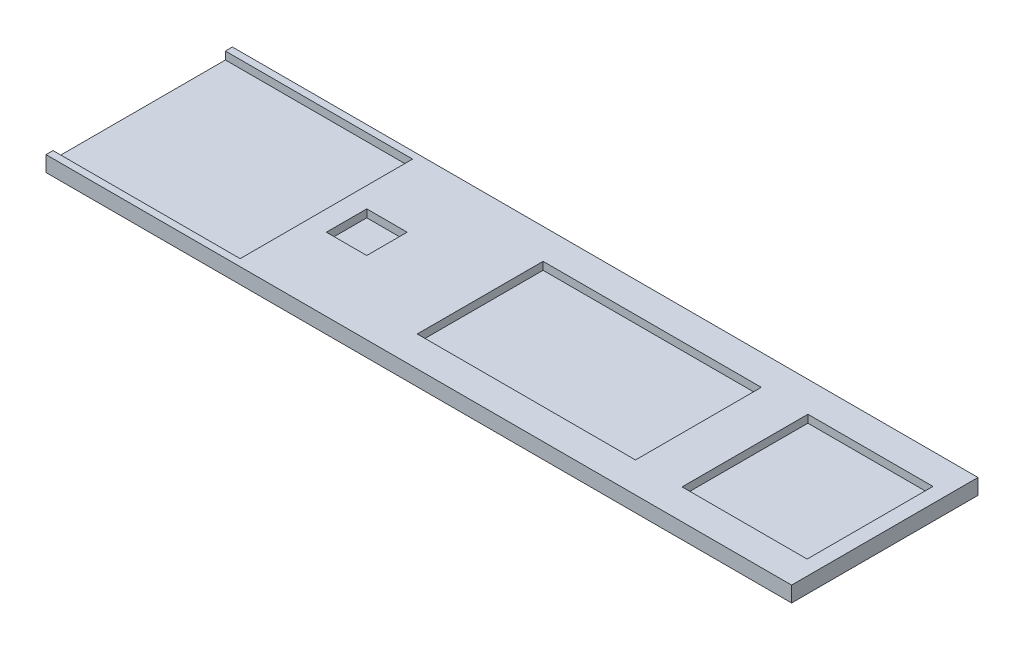
ISO-10303-21;
HEADER;
FILE_DESCRIPTION(('STEP AP214'),'2;1');
FILE_NAME('part.step','',(''),(''),'','','');
FILE_SCHEMA(('AUTOMOTIVE_DESIGN { 1 0 10303 214 1 1 1 1 }'));
ENDSEC;
DATA;
#1=APPLICATION_CONTEXT('core data for automotive mechanical design processes');
#2=APPLICATION_PROTOCOL_DEFINITION('international standard','automotive_design',2000,#1);
#3=PRODUCT_CONTEXT('',#1,'mechanical');
#4=PRODUCT('Part','Part','',(#3));
#5=PRODUCT_RELATED_PRODUCT_CATEGORY('part','',(#4));
#6=PRODUCT_DEFINITION_FORMATION('','',#4);
#7=PRODUCT_DEFINITION_CONTEXT('part definition',#1,'design');
#8=PRODUCT_DEFINITION('design','',#6,#7);
#9=PRODUCT_DEFINITION_SHAPE('','',#8);
#10=(LENGTH_UNIT() NAMED_UNIT(*) SI_UNIT(.MILLI.,.METRE.));
#11=(NAMED_UNIT(*) PLANE_ANGLE_UNIT() SI_UNIT($,.RADIAN.));
#12=(NAMED_UNIT(*) SI_UNIT($,.STERADIAN.) SOLID_ANGLE_UNIT());
#13=UNCERTAINTY_MEASURE_WITH_UNIT(LENGTH_MEASURE(1.E-05),#10,'distance_accuracy_value','');
#14=(GEOMETRIC_REPRESENTATION_CONTEXT(3) GLOBAL_UNCERTAINTY_ASSIGNED_CONTEXT((#13)) GLOBAL_UNIT_ASSIGNED_CONTEXT((#10,
#11,#12)) REPRESENTATION_CONTEXT('',''));
#15=CARTESIAN_POINT('',(0.,0.,0.));
#16=DIRECTION('',(0.,0.,1.));
#17=DIRECTION('',(1.,0.,0.));
#18=AXIS2_PLACEMENT_3D('',#15,#16,#17);
#19=CARTESIAN_POINT('',(-4.54092526690392,5.,-57.6868327402135));
#20=DIRECTION('',(1.,0.,0.));
#21=DIRECTION('',(0.,0.,-1.));
#22=AXIS2_PLACEMENT_3D('',#19,#20,#21);
#23=PLANE('',#22);
#24=DIRECTION('',(0.,0.,1.));
#25=VECTOR('',#24,1.);
#26=CARTESIAN_POINT('',(-4.54092526690392,2.5,-55.4368327402135));
#27=LINE('',#26,#25);
#28=CARTESIAN_POINT('',(-4.54092526690392,2.5,-55.4368327402135));
#29=VERTEX_POINT('',#28);
#30=CARTESIAN_POINT('',(-4.54092526690391,2.5,0.0631672597864799));
#31=VERTEX_POINT('',#30);
#32=EDGE_CURVE('E338',#29,#31,#27,.T.);
#33=ORIENTED_EDGE('',*,*,#32,.F.);
#34=DIRECTION('',(0.,1.,0.));
#35=VECTOR('',#34,1.);
#36=CARTESIAN_POINT('',(-4.54092526690392,2.5,-55.4368327402135));
#37=LINE('',#36,#35);
#38=CARTESIAN_POINT('',(-4.54092526690392,5.,-55.4368327402135));
#39=VERTEX_POINT('',#38);
#40=EDGE_CURVE('E330',#29,#39,#37,.T.);
#41=ORIENTED_EDGE('',*,*,#40,.T.);
#42=DIRECTION('',(0.,0.,1.));
#43=VECTOR('',#42,1.);
#44=CARTESIAN_POINT('',(-4.54092526690392,5.,-57.6868327402135));
#45=LINE('',#44,#43);
#46=CARTESIAN_POINT('',(-4.54092526690392,5.,-57.6868327402135));
#47=VERTEX_POINT('',#46);
#48=EDGE_CURVE('E359',#47,#39,#45,.T.);
#49=ORIENTED_EDGE('',*,*,#48,.F.);
#50=DIRECTION('',(0.,-1.,0.));
#51=VECTOR('',#50,1.);
#52=CARTESIAN_POINT('',(-4.54092526690392,5.,-57.6868327402135));
#53=LINE('',#52,#51);
#54=CARTESIAN_POINT('',(-4.54092526690392,0.,-57.6868327402135));
#55=VERTEX_POINT('',#54);
#56=EDGE_CURVE('E373',#47,#55,#53,.T.);
#57=ORIENTED_EDGE('',*,*,#56,.T.);
#58=DIRECTION('',(0.,0.,1.));
#59=VECTOR('',#58,1.);
#60=CARTESIAN_POINT('',(-4.54092526690392,0.,-57.6868327402135));
#61=LINE('',#60,#59);
#62=CARTESIAN_POINT('',(-4.54092526690391,0.,2.31316725978648));
#63=VERTEX_POINT('',#62);
#64=EDGE_CURVE('E227',#55,#63,#61,.T.);
#65=ORIENTED_EDGE('',*,*,#64,.T.);
#66=DIRECTION('',(0.,-1.,0.));
#67=VECTOR('',#66,1.);
#68=CARTESIAN_POINT('',(-4.54092526690391,5.,2.31316725978648));
#69=LINE('',#68,#67);
#70=CARTESIAN_POINT('',(-4.54092526690391,5.,2.31316725978648));
#71=VERTEX_POINT('',#70);
#72=EDGE_CURVE('E11',#71,#63,#69,.T.);
#73=ORIENTED_EDGE('',*,*,#72,.F.);
#74=CARTESIAN_POINT('',(-4.54092526690391,5.,0.0631672597864799));
#75=VERTEX_POINT('',#74);
#76=EDGE_CURVE('E364',#75,#71,#45,.T.);
#77=ORIENTED_EDGE('',*,*,#76,.F.);
#78=DIRECTION('',(0.,1.,0.));
#79=VECTOR('',#78,1.);
#80=CARTESIAN_POINT('',(-4.54092526690391,2.5,0.0631672597864799));
#81=LINE('',#80,#79);
#82=EDGE_CURVE('E320',#31,#75,#81,.T.);
#83=ORIENTED_EDGE('',*,*,#82,.F.);
#84=EDGE_LOOP('',(#33,#41,#49,#57,#65,#73,#77,#83));
#85=FACE_BOUND('',#84,.T.);
#86=ADVANCED_FACE('F45',(#85),#23,.F.);
#87=CARTESIAN_POINT('',(-4.54092526690391,5.,2.31316725978648));
#88=DIRECTION('',(0.,0.,-1.));
#89=DIRECTION('',(-1.,0.,0.));
#90=AXIS2_PLACEMENT_3D('',#87,#88,#89);
#91=PLANE('',#90);
#92=DIRECTION('',(1.,0.,0.));
#93=VECTOR('',#92,1.);
#94=CARTESIAN_POINT('',(-4.54092526690391,0.,2.31316725978648));
#95=LINE('',#94,#93);
#96=CARTESIAN_POINT('',(235.459074733096,0.,2.31316725978647));
#97=VERTEX_POINT('',#96);
#98=EDGE_CURVE('E377',#63,#97,#95,.T.);
#99=ORIENTED_EDGE('',*,*,#98,.T.);
#100=DIRECTION('',(0.,-1.,0.));
#101=VECTOR('',#100,1.);
#102=CARTESIAN_POINT('',(235.459074733096,5.,2.31316725978647));
#103=LINE('',#102,#101);
#104=CARTESIAN_POINT('',(235.459074733096,5.,2.31316725978647));
#105=VERTEX_POINT('',#104);
#106=EDGE_CURVE('E53',#105,#97,#103,.T.);
#107=ORIENTED_EDGE('',*,*,#106,.F.);
#108=DIRECTION('',(1.,0.,0.));
#109=VECTOR('',#108,1.);
#110=CARTESIAN_POINT('',(-4.54092526690391,5.,2.31316725978648));
#111=LINE('',#110,#109);
#112=EDGE_CURVE('E363',#71,#105,#111,.T.);
#113=ORIENTED_EDGE('',*,*,#112,.F.);
#114=ORIENTED_EDGE('',*,*,#72,.T.);
#115=EDGE_LOOP('',(#99,#107,#113,#114));
#116=FACE_BOUND('',#115,.T.);
#117=ADVANCED_FACE('F420',(#116),#91,.F.);
#118=CARTESIAN_POINT('',(235.459074733096,5.,-57.6868327402135));
#119=DIRECTION('',(-1.,0.,0.));
#120=DIRECTION('',(0.,0.,1.));
#121=AXIS2_PLACEMENT_3D('',#118,#119,#120);
#122=PLANE('',#121);
#123=DIRECTION('',(0.,0.,-1.));
#124=VECTOR('',#123,1.);
#125=CARTESIAN_POINT('',(235.459074733096,0.,-57.6868327402135));
#126=LINE('',#125,#124);
#127=CARTESIAN_POINT('',(235.459074733096,0.,-57.6868327402135));
#128=VERTEX_POINT('',#127);
#129=EDGE_CURVE('E380',#97,#128,#126,.T.);
#130=ORIENTED_EDGE('',*,*,#129,.T.);
#131=DIRECTION('',(0.,-1.,0.));
#132=VECTOR('',#131,1.);
#133=CARTESIAN_POINT('',(235.459074733096,5.,-57.6868327402135));
#134=LINE('',#133,#132);
#135=CARTESIAN_POINT('',(235.459074733096,5.,-57.6868327402135));
#136=VERTEX_POINT('',#135);
#137=EDGE_CURVE('E389',#136,#128,#134,.T.);
#138=ORIENTED_EDGE('',*,*,#137,.F.);
#139=DIRECTION('',(0.,0.,-1.));
#140=VECTOR('',#139,1.);
#141=CARTESIAN_POINT('',(235.459074733096,5.,-57.6868327402135));
#142=LINE('',#141,#140);
#143=EDGE_CURVE('E367',#105,#136,#142,.T.);
#144=ORIENTED_EDGE('',*,*,#143,.F.);
#145=ORIENTED_EDGE('',*,*,#106,.T.);
#146=EDGE_LOOP('',(#130,#138,#144,#145));
#147=FACE_BOUND('',#146,.T.);
#148=ADVANCED_FACE('F398',(#147),#122,.F.);
#149=CARTESIAN_POINT('',(-4.54092526690392,5.,-57.6868327402135));
#150=DIRECTION('',(0.,0.,1.));
#151=DIRECTION('',(1.,0.,0.));
#152=AXIS2_PLACEMENT_3D('',#149,#150,#151);
#153=PLANE('',#152);
#154=DIRECTION('',(-1.,0.,0.));
#155=VECTOR('',#154,1.);
#156=CARTESIAN_POINT('',(-4.54092526690392,0.,-57.6868327402135));
#157=LINE('',#156,#155);
#158=EDGE_CURVE('E383',#128,#55,#157,.T.);
#159=ORIENTED_EDGE('',*,*,#158,.T.);
#160=ORIENTED_EDGE('',*,*,#56,.F.);
#161=DIRECTION('',(-1.,0.,0.));
#162=VECTOR('',#161,1.);
#163=CARTESIAN_POINT('',(-4.54092526690392,5.,-57.6868327402135));
#164=LINE('',#163,#162);
#165=EDGE_CURVE('E370',#136,#47,#164,.T.);
#166=ORIENTED_EDGE('',*,*,#165,.F.);
#167=ORIENTED_EDGE('',*,*,#137,.T.);
#168=EDGE_LOOP('',(#159,#160,#166,#167));
#169=FACE_BOUND('',#168,.T.);
#170=ADVANCED_FACE('F408',(#169),#153,.F.);
#171=CARTESIAN_POINT('',(0.,5.,0.));
#172=DIRECTION('',(0.,1.,0.));
#173=DIRECTION('',(0.,0.,1.));
#174=AXIS2_PLACEMENT_3D('',#171,#172,#173);
#175=PLANE('',#174);
#176=DIRECTION('',(0.,0.,1.));
#177=VECTOR('',#176,1.);
#178=CARTESIAN_POINT('',(190.459074733096,5.,-47.9368327402135));
#179=LINE('',#178,#177);
#180=CARTESIAN_POINT('',(190.459074733096,5.,-47.9368327402135));
#181=VERTEX_POINT('',#180);
#182=CARTESIAN_POINT('',(190.459074733096,5.,-7.43683274021352));
#183=VERTEX_POINT('',#182);
#184=EDGE_CURVE('E60',#181,#183,#179,.T.);
#185=ORIENTED_EDGE('',*,*,#184,.F.);
#186=DIRECTION('',(-1.,0.,0.));
#187=VECTOR('',#186,1.);
#188=CARTESIAN_POINT('',(190.459074733096,5.,-47.9368327402135));
#189=LINE('',#188,#187);
#190=CARTESIAN_POINT('',(230.709074733096,5.,-47.9368327402135));
#191=VERTEX_POINT('',#190);
#192=EDGE_CURVE('E205',#191,#181,#189,.T.);
#193=ORIENTED_EDGE('',*,*,#192,.F.);
#194=DIRECTION('',(0.,0.,-1.));
#195=VECTOR('',#194,1.);
#196=CARTESIAN_POINT('',(230.709074733096,5.,-47.9368327402135));
#197=LINE('',#196,#195);
#198=CARTESIAN_POINT('',(230.709074733096,5.,-7.43683274021352));
#199=VERTEX_POINT('',#198);
#200=EDGE_CURVE('E209',#199,#191,#197,.T.);
#201=ORIENTED_EDGE('',*,*,#200,.F.);
#202=DIRECTION('',(1.,0.,0.));
#203=VECTOR('',#202,1.);
#204=CARTESIAN_POINT('',(190.459074733096,5.,-7.43683274021352));
#205=LINE('',#204,#203);
#206=EDGE_CURVE('E218',#183,#199,#205,.T.);
#207=ORIENTED_EDGE('',*,*,#206,.F.);
#208=EDGE_LOOP('',(#185,#193,#201,#207));
#209=FACE_BOUND('',#208,.T.);
#210=DIRECTION('',(0.,0.,1.));
#211=VECTOR('',#210,1.);
#212=CARTESIAN_POINT('',(105.209074733096,5.,-47.9368327402135));
#213=LINE('',#212,#211);
#214=CARTESIAN_POINT('',(105.209074733096,5.,-47.9368327402135));
#215=VERTEX_POINT('',#214);
#216=CARTESIAN_POINT('',(105.209074733096,5.,-7.43683274021352));
#217=VERTEX_POINT('',#216);
#218=EDGE_CURVE('E68',#215,#217,#213,.T.);
#219=ORIENTED_EDGE('',*,*,#218,.F.);
#220=DIRECTION('',(-1.,0.,0.));
#221=VECTOR('',#220,1.);
#222=CARTESIAN_POINT('',(105.209074733096,5.,-47.9368327402135));
#223=LINE('',#222,#221);
#224=CARTESIAN_POINT('',(175.459074733096,5.,-47.9368327402135));
#225=VERTEX_POINT('',#224);
#226=EDGE_CURVE('E247',#225,#215,#223,.T.);
#227=ORIENTED_EDGE('',*,*,#226,.F.);
#228=DIRECTION('',(0.,0.,-1.));
#229=VECTOR('',#228,1.);
#230=CARTESIAN_POINT('',(175.459074733096,5.,-47.9368327402135));
#231=LINE('',#230,#229);
#232=CARTESIAN_POINT('',(175.459074733096,5.,-7.43683274021352));
#233=VERTEX_POINT('',#232);
#234=EDGE_CURVE('E251',#233,#225,#231,.T.);
#235=ORIENTED_EDGE('',*,*,#234,.F.);
#236=DIRECTION('',(1.,0.,0.));
#237=VECTOR('',#236,1.);
#238=CARTESIAN_POINT('',(105.209074733096,5.,-7.43683274021352));
#239=LINE('',#238,#237);
#240=EDGE_CURVE('E256',#217,#233,#239,.T.);
#241=ORIENTED_EDGE('',*,*,#240,.F.);
#242=EDGE_LOOP('',(#219,#227,#235,#241));
#243=FACE_BOUND('',#242,.T.);
#244=DIRECTION('',(0.,0.,1.));
#245=VECTOR('',#244,1.);
#246=CARTESIAN_POINT('',(62.2090747330961,5.,-34.1868327402135));
#247=LINE('',#246,#245);
#248=CARTESIAN_POINT('',(62.2090747330961,5.,-34.1868327402135));
#249=VERTEX_POINT('',#248);
#250=CARTESIAN_POINT('',(62.2090747330961,5.,-21.1868327402135));
#251=VERTEX_POINT('',#250);
#252=EDGE_CURVE('E246',#249,#251,#247,.T.);
#253=ORIENTED_EDGE('',*,*,#252,.F.);
#254=DIRECTION('',(-1.,0.,0.));
#255=VECTOR('',#254,1.);
#256=CARTESIAN_POINT('',(62.2090747330961,5.,-34.1868327402135));
#257=LINE('',#256,#255);
#258=CARTESIAN_POINT('',(75.2090747330961,5.,-34.1868327402135));
#259=VERTEX_POINT('',#258);
#260=EDGE_CURVE('E291',#259,#249,#257,.T.);
#261=ORIENTED_EDGE('',*,*,#260,.F.);
#262=DIRECTION('',(0.,0.,-1.));
#263=VECTOR('',#262,1.);
#264=CARTESIAN_POINT('',(75.2090747330961,5.,-34.1868327402135));
#265=LINE('',#264,#263);
#266=CARTESIAN_POINT('',(75.2090747330961,5.,-21.1868327402135));
#267=VERTEX_POINT('',#266);
#268=EDGE_CURVE('E295',#267,#259,#265,.T.);
#269=ORIENTED_EDGE('',*,*,#268,.F.);
#270=DIRECTION('',(1.,0.,0.));
#271=VECTOR('',#270,1.);
#272=CARTESIAN_POINT('',(62.2090747330961,5.,-21.1868327402135));
#273=LINE('',#272,#271);
#274=EDGE_CURVE('E300',#251,#267,#273,.T.);
#275=ORIENTED_EDGE('',*,*,#274,.F.);
#276=EDGE_LOOP('',(#253,#261,#269,#275));
#277=FACE_BOUND('',#276,.T.);
#278=DIRECTION('',(-1.,0.,0.));
#279=VECTOR('',#278,1.);
#280=CARTESIAN_POINT('',(-4.54092526690392,5.,-55.4368327402135));
#281=LINE('',#280,#279);
#282=CARTESIAN_POINT('',(55.7090747330961,5.,-55.4368327402135));
#283=VERTEX_POINT('',#282);
#284=EDGE_CURVE('E334',#283,#39,#281,.T.);
#285=ORIENTED_EDGE('',*,*,#284,.F.);
#286=DIRECTION('',(0.,0.,-1.));
#287=VECTOR('',#286,1.);
#288=CARTESIAN_POINT('',(55.7090747330961,5.,-55.4368327402135));
#289=LINE('',#288,#287);
#290=CARTESIAN_POINT('',(55.7090747330961,5.,0.0631672597864799));
#291=VERTEX_POINT('',#290);
#292=EDGE_CURVE('E337',#291,#283,#289,.T.);
#293=ORIENTED_EDGE('',*,*,#292,.F.);
#294=DIRECTION('',(1.,0.,0.));
#295=VECTOR('',#294,1.);
#296=CARTESIAN_POINT('',(-4.54092526690391,5.,0.0631672597864799));
#297=LINE('',#296,#295);
#298=EDGE_CURVE('E290',#75,#291,#297,.T.);
#299=ORIENTED_EDGE('',*,*,#298,.F.);
#300=ORIENTED_EDGE('',*,*,#76,.T.);
#301=ORIENTED_EDGE('',*,*,#112,.T.);
#302=ORIENTED_EDGE('',*,*,#143,.T.);
#303=ORIENTED_EDGE('',*,*,#165,.T.);
#304=ORIENTED_EDGE('',*,*,#48,.T.);
#305=EDGE_LOOP('',(#285,#293,#299,#300,#301,#302,#303,#304));
#306=FACE_BOUND('',#305,.T.);
#307=ADVANCED_FACE('F416',(#209,#243,#277,#306),#175,.T.);
#308=CARTESIAN_POINT('',(0.,0.,0.));
#309=DIRECTION('',(0.,1.,0.));
#310=DIRECTION('',(0.,0.,1.));
#311=AXIS2_PLACEMENT_3D('',#308,#309,#310);
#312=PLANE('',#311);
#313=ORIENTED_EDGE('',*,*,#64,.F.);
#314=ORIENTED_EDGE('',*,*,#158,.F.);
#315=ORIENTED_EDGE('',*,*,#129,.F.);
#316=ORIENTED_EDGE('',*,*,#98,.F.);
#317=EDGE_LOOP('',(#313,#314,#315,#316));
#318=FACE_BOUND('',#317,.T.);
#319=ADVANCED_FACE('F405',(#318),#312,.F.);
#320=CARTESIAN_POINT('',(-4.54092526690392,2.5,-55.4368327402135));
#321=DIRECTION('',(0.,0.,-1.));
#322=DIRECTION('',(-1.,0.,0.));
#323=AXIS2_PLACEMENT_3D('',#320,#321,#322);
#324=PLANE('',#323);
#325=ORIENTED_EDGE('',*,*,#284,.T.);
#326=ORIENTED_EDGE('',*,*,#40,.F.);
#327=DIRECTION('',(-1.,0.,0.));
#328=VECTOR('',#327,1.);
#329=CARTESIAN_POINT('',(-4.54092526690392,2.5,-55.4368327402135));
#330=LINE('',#329,#328);
#331=CARTESIAN_POINT('',(55.7090747330961,2.5,-55.4368327402135));
#332=VERTEX_POINT('',#331);
#333=EDGE_CURVE('E323',#332,#29,#330,.T.);
#334=ORIENTED_EDGE('',*,*,#333,.F.);
#335=DIRECTION('',(0.,1.,0.));
#336=VECTOR('',#335,1.);
#337=CARTESIAN_POINT('',(55.7090747330961,2.5,-55.4368327402135));
#338=LINE('',#337,#336);
#339=EDGE_CURVE('E327',#332,#283,#338,.T.);
#340=ORIENTED_EDGE('',*,*,#339,.T.);
#341=EDGE_LOOP('',(#325,#326,#334,#340));
#342=FACE_BOUND('',#341,.T.);
#343=ADVANCED_FACE('F432',(#342),#324,.F.);
#344=CARTESIAN_POINT('',(55.7090747330961,2.5,-55.4368327402135));
#345=DIRECTION('',(1.,0.,0.));
#346=DIRECTION('',(0.,0.,-1.));
#347=AXIS2_PLACEMENT_3D('',#344,#345,#346);
#348=PLANE('',#347);
#349=ORIENTED_EDGE('',*,*,#292,.T.);
#350=ORIENTED_EDGE('',*,*,#339,.F.);
#351=DIRECTION('',(0.,0.,-1.));
#352=VECTOR('',#351,1.);
#353=CARTESIAN_POINT('',(55.7090747330961,2.5,-55.4368327402135));
#354=LINE('',#353,#352);
#355=CARTESIAN_POINT('',(55.7090747330961,2.5,0.0631672597864799));
#356=VERTEX_POINT('',#355);
#357=EDGE_CURVE('E348',#356,#332,#354,.T.);
#358=ORIENTED_EDGE('',*,*,#357,.F.);
#359=DIRECTION('',(0.,1.,0.));
#360=VECTOR('',#359,1.);
#361=CARTESIAN_POINT('',(55.7090747330961,2.5,0.0631672597864799));
#362=LINE('',#361,#360);
#363=EDGE_CURVE('E324',#356,#291,#362,.T.);
#364=ORIENTED_EDGE('',*,*,#363,.T.);
#365=EDGE_LOOP('',(#349,#350,#358,#364));
#366=FACE_BOUND('',#365,.T.);
#367=ADVANCED_FACE('F426',(#366),#348,.F.);
#368=CARTESIAN_POINT('',(-4.54092526690391,2.5,0.0631672597864799));
#369=DIRECTION('',(0.,0.,1.));
#370=DIRECTION('',(1.,0.,0.));
#371=AXIS2_PLACEMENT_3D('',#368,#369,#370);
#372=PLANE('',#371);
#373=ORIENTED_EDGE('',*,*,#298,.T.);
#374=ORIENTED_EDGE('',*,*,#363,.F.);
#375=DIRECTION('',(1.,0.,0.));
#376=VECTOR('',#375,1.);
#377=CARTESIAN_POINT('',(-4.54092526690391,2.5,0.0631672597864799));
#378=LINE('',#377,#376);
#379=EDGE_CURVE('E352',#31,#356,#378,.T.);
#380=ORIENTED_EDGE('',*,*,#379,.F.);
#381=ORIENTED_EDGE('',*,*,#82,.T.);
#382=EDGE_LOOP('',(#373,#374,#380,#381));
#383=FACE_BOUND('',#382,.T.);
#384=ADVANCED_FACE('F424',(#383),#372,.F.);
#385=CARTESIAN_POINT('',(0.,2.5,0.));
#386=DIRECTION('',(0.,1.,0.));
#387=DIRECTION('',(0.,0.,1.));
#388=AXIS2_PLACEMENT_3D('',#385,#386,#387);
#389=PLANE('',#388);
#390=ORIENTED_EDGE('',*,*,#32,.T.);
#391=ORIENTED_EDGE('',*,*,#379,.T.);
#392=ORIENTED_EDGE('',*,*,#357,.T.);
#393=ORIENTED_EDGE('',*,*,#333,.T.);
#394=EDGE_LOOP('',(#390,#391,#392,#393));
#395=FACE_BOUND('',#394,.T.);
#396=ADVANCED_FACE('F430',(#395),#389,.T.);
#397=CARTESIAN_POINT('',(62.2090747330961,2.5,-34.1868327402135));
#398=DIRECTION('',(-1.,0.,0.));
#399=DIRECTION('',(0.,0.,1.));
#400=AXIS2_PLACEMENT_3D('',#397,#398,#399);
#401=PLANE('',#400);
#402=ORIENTED_EDGE('',*,*,#252,.T.);
#403=DIRECTION('',(0.,1.,0.));
#404=VECTOR('',#403,1.);
#405=CARTESIAN_POINT('',(62.2090747330961,2.5,-21.1868327402135));
#406=LINE('',#405,#404);
#407=CARTESIAN_POINT('',(62.2090747330961,2.5,-21.1868327402135));
#408=VERTEX_POINT('',#407);
#409=EDGE_CURVE('E276',#408,#251,#406,.T.);
#410=ORIENTED_EDGE('',*,*,#409,.F.);
#411=DIRECTION('',(0.,0.,1.));
#412=VECTOR('',#411,1.);
#413=CARTESIAN_POINT('',(62.2090747330961,2.5,-34.1868327402135));
#414=LINE('',#413,#412);
#415=CARTESIAN_POINT('',(62.2090747330961,2.5,-34.1868327402135));
#416=VERTEX_POINT('',#415);
#417=EDGE_CURVE('E296',#416,#408,#414,.T.);
#418=ORIENTED_EDGE('',*,*,#417,.F.);
#419=DIRECTION('',(0.,1.,0.));
#420=VECTOR('',#419,1.);
#421=CARTESIAN_POINT('',(62.2090747330961,2.5,-34.1868327402135));
#422=LINE('',#421,#420);
#423=EDGE_CURVE('E287',#416,#249,#422,.T.);
#424=ORIENTED_EDGE('',*,*,#423,.T.);
#425=EDGE_LOOP('',(#402,#410,#418,#424));
#426=FACE_BOUND('',#425,.T.);
#427=ADVANCED_FACE('F456',(#426),#401,.F.);
#428=CARTESIAN_POINT('',(62.2090747330961,2.5,-34.1868327402135));
#429=DIRECTION('',(0.,0.,-1.));
#430=DIRECTION('',(-1.,0.,0.));
#431=AXIS2_PLACEMENT_3D('',#428,#429,#430);
#432=PLANE('',#431);
#433=ORIENTED_EDGE('',*,*,#260,.T.);
#434=ORIENTED_EDGE('',*,*,#423,.F.);
#435=DIRECTION('',(-1.,0.,0.));
#436=VECTOR('',#435,1.);
#437=CARTESIAN_POINT('',(62.2090747330961,2.5,-34.1868327402135));
#438=LINE('',#437,#436);
#439=CARTESIAN_POINT('',(75.2090747330961,2.5,-34.1868327402135));
#440=VERTEX_POINT('',#439);
#441=EDGE_CURVE('E280',#440,#416,#438,.T.);
#442=ORIENTED_EDGE('',*,*,#441,.F.);
#443=DIRECTION('',(0.,1.,0.));
#444=VECTOR('',#443,1.);
#445=CARTESIAN_POINT('',(75.2090747330961,2.5,-34.1868327402135));
#446=LINE('',#445,#444);
#447=EDGE_CURVE('E284',#440,#259,#446,.T.);
#448=ORIENTED_EDGE('',*,*,#447,.T.);
#449=EDGE_LOOP('',(#433,#434,#442,#448));
#450=FACE_BOUND('',#449,.T.);
#451=ADVANCED_FACE('F461',(#450),#432,.F.);
#452=CARTESIAN_POINT('',(75.2090747330961,2.5,-34.1868327402135));
#453=DIRECTION('',(1.,0.,0.));
#454=DIRECTION('',(0.,0.,-1.));
#455=AXIS2_PLACEMENT_3D('',#452,#453,#454);
#456=PLANE('',#455);
#457=ORIENTED_EDGE('',*,*,#268,.T.);
#458=ORIENTED_EDGE('',*,*,#447,.F.);
#459=DIRECTION('',(0.,0.,-1.));
#460=VECTOR('',#459,1.);
#461=CARTESIAN_POINT('',(75.2090747330961,2.5,-34.1868327402135));
#462=LINE('',#461,#460);
#463=CARTESIAN_POINT('',(75.2090747330961,2.5,-21.1868327402135));
#464=VERTEX_POINT('',#463);
#465=EDGE_CURVE('E309',#464,#440,#462,.T.);
#466=ORIENTED_EDGE('',*,*,#465,.F.);
#467=DIRECTION('',(0.,1.,0.));
#468=VECTOR('',#467,1.);
#469=CARTESIAN_POINT('',(75.2090747330961,2.5,-21.1868327402135));
#470=LINE('',#469,#468);
#471=EDGE_CURVE('E281',#464,#267,#470,.T.);
#472=ORIENTED_EDGE('',*,*,#471,.T.);
#473=EDGE_LOOP('',(#457,#458,#466,#472));
#474=FACE_BOUND('',#473,.T.);
#475=ADVANCED_FACE('F476',(#474),#456,.F.);
#476=CARTESIAN_POINT('',(62.2090747330961,2.5,-21.1868327402135));
#477=DIRECTION('',(0.,0.,1.));
#478=DIRECTION('',(1.,0.,0.));
#479=AXIS2_PLACEMENT_3D('',#476,#477,#478);
#480=PLANE('',#479);
#481=ORIENTED_EDGE('',*,*,#274,.T.);
#482=ORIENTED_EDGE('',*,*,#471,.F.);
#483=DIRECTION('',(1.,0.,0.));
#484=VECTOR('',#483,1.);
#485=CARTESIAN_POINT('',(62.2090747330961,2.5,-21.1868327402135));
#486=LINE('',#485,#484);
#487=EDGE_CURVE('E313',#408,#464,#486,.T.);
#488=ORIENTED_EDGE('',*,*,#487,.F.);
#489=ORIENTED_EDGE('',*,*,#409,.T.);
#490=EDGE_LOOP('',(#481,#482,#488,#489));
#491=FACE_BOUND('',#490,.T.);
#492=ADVANCED_FACE('F472',(#491),#480,.F.);
#493=CARTESIAN_POINT('',(0.,2.5,0.));
#494=DIRECTION('',(0.,1.,0.));
#495=DIRECTION('',(0.,0.,1.));
#496=AXIS2_PLACEMENT_3D('',#493,#494,#495);
#497=PLANE('',#496);
#498=ORIENTED_EDGE('',*,*,#417,.T.);
#499=ORIENTED_EDGE('',*,*,#487,.T.);
#500=ORIENTED_EDGE('',*,*,#465,.T.);
#501=ORIENTED_EDGE('',*,*,#441,.T.);
#502=EDGE_LOOP('',(#498,#499,#500,#501));
#503=FACE_BOUND('',#502,.T.);
#504=ADVANCED_FACE('F468',(#503),#497,.T.);
#505=CARTESIAN_POINT('',(105.209074733096,2.5,-47.9368327402135));
#506=DIRECTION('',(-1.,0.,0.));
#507=DIRECTION('',(0.,0.,1.));
#508=AXIS2_PLACEMENT_3D('',#505,#506,#507);
#509=PLANE('',#508);
#510=ORIENTED_EDGE('',*,*,#218,.T.);
#511=DIRECTION('',(0.,1.,0.));
#512=VECTOR('',#511,1.);
#513=CARTESIAN_POINT('',(105.209074733096,2.5,-7.43683274021352));
#514=LINE('',#513,#512);
#515=CARTESIAN_POINT('',(105.209074733096,2.5,-7.43683274021352));
#516=VERTEX_POINT('',#515);
#517=EDGE_CURVE('E233',#516,#217,#514,.T.);
#518=ORIENTED_EDGE('',*,*,#517,.F.);
#519=DIRECTION('',(0.,0.,1.));
#520=VECTOR('',#519,1.);
#521=CARTESIAN_POINT('',(105.209074733096,2.5,-47.9368327402135));
#522=LINE('',#521,#520);
#523=CARTESIAN_POINT('',(105.209074733096,2.5,-47.9368327402135));
#524=VERTEX_POINT('',#523);
#525=EDGE_CURVE('E252',#524,#516,#522,.T.);
#526=ORIENTED_EDGE('',*,*,#525,.F.);
#527=DIRECTION('',(0.,1.,0.));
#528=VECTOR('',#527,1.);
#529=CARTESIAN_POINT('',(105.209074733096,2.5,-47.9368327402135));
#530=LINE('',#529,#528);
#531=EDGE_CURVE('E243',#524,#215,#530,.T.);
#532=ORIENTED_EDGE('',*,*,#531,.T.);
#533=EDGE_LOOP('',(#510,#518,#526,#532));
#534=FACE_BOUND('',#533,.T.);
#535=ADVANCED_FACE('F471',(#534),#509,.F.);
#536=CARTESIAN_POINT('',(105.209074733096,2.5,-47.9368327402135));
#537=DIRECTION('',(0.,0.,-1.));
#538=DIRECTION('',(-1.,0.,0.));
#539=AXIS2_PLACEMENT_3D('',#536,#537,#538);
#540=PLANE('',#539);
#541=ORIENTED_EDGE('',*,*,#226,.T.);
#542=ORIENTED_EDGE('',*,*,#531,.F.);
#543=DIRECTION('',(-1.,0.,0.));
#544=VECTOR('',#543,1.);
#545=CARTESIAN_POINT('',(105.209074733096,2.5,-47.9368327402135));
#546=LINE('',#545,#544);
#547=CARTESIAN_POINT('',(175.459074733096,2.5,-47.9368327402135));
#548=VERTEX_POINT('',#547);
#549=EDGE_CURVE('E236',#548,#524,#546,.T.);
#550=ORIENTED_EDGE('',*,*,#549,.F.);
#551=DIRECTION('',(0.,1.,0.));
#552=VECTOR('',#551,1.);
#553=CARTESIAN_POINT('',(175.459074733096,2.5,-47.9368327402135));
#554=LINE('',#553,#552);
#555=EDGE_CURVE('E240',#548,#225,#554,.T.);
#556=ORIENTED_EDGE('',*,*,#555,.T.);
#557=EDGE_LOOP('',(#541,#542,#550,#556));
#558=FACE_BOUND('',#557,.T.);
#559=ADVANCED_FACE('F489',(#558),#540,.F.);
#560=CARTESIAN_POINT('',(175.459074733096,2.5,-47.9368327402135));
#561=DIRECTION('',(1.,0.,0.));
#562=DIRECTION('',(0.,0.,-1.));
#563=AXIS2_PLACEMENT_3D('',#560,#561,#562);
#564=PLANE('',#563);
#565=ORIENTED_EDGE('',*,*,#234,.T.);
#566=ORIENTED_EDGE('',*,*,#555,.F.);
#567=DIRECTION('',(0.,0.,-1.));
#568=VECTOR('',#567,1.);
#569=CARTESIAN_POINT('',(175.459074733096,2.5,-47.9368327402135));
#570=LINE('',#569,#568);
#571=CARTESIAN_POINT('',(175.459074733096,2.5,-7.43683274021352));
#572=VERTEX_POINT('',#571);
#573=EDGE_CURVE('E265',#572,#548,#570,.T.);
#574=ORIENTED_EDGE('',*,*,#573,.F.);
#575=DIRECTION('',(0.,1.,0.));
#576=VECTOR('',#575,1.);
#577=CARTESIAN_POINT('',(175.459074733096,2.5,-7.43683274021352));
#578=LINE('',#577,#576);
#579=EDGE_CURVE('E237',#572,#233,#578,.T.);
#580=ORIENTED_EDGE('',*,*,#579,.T.);
#581=EDGE_LOOP('',(#565,#566,#574,#580));
#582=FACE_BOUND('',#581,.T.);
#583=ADVANCED_FACE('F492',(#582),#564,.F.);
#584=CARTESIAN_POINT('',(105.209074733096,2.5,-7.43683274021352));
#585=DIRECTION('',(0.,0.,1.));
#586=DIRECTION('',(1.,0.,0.));
#587=AXIS2_PLACEMENT_3D('',#584,#585,#586);
#588=PLANE('',#587);
#589=ORIENTED_EDGE('',*,*,#240,.T.);
#590=ORIENTED_EDGE('',*,*,#579,.F.);
#591=DIRECTION('',(1.,0.,0.));
#592=VECTOR('',#591,1.);
#593=CARTESIAN_POINT('',(105.209074733096,2.5,-7.43683274021352));
#594=LINE('',#593,#592);
#595=EDGE_CURVE('E269',#516,#572,#594,.T.);
#596=ORIENTED_EDGE('',*,*,#595,.F.);
#597=ORIENTED_EDGE('',*,*,#517,.T.);
#598=EDGE_LOOP('',(#589,#590,#596,#597));
#599=FACE_BOUND('',#598,.T.);
#600=ADVANCED_FACE('F487',(#599),#588,.F.);
#601=CARTESIAN_POINT('',(0.,2.5,0.));
#602=DIRECTION('',(0.,1.,0.));
#603=DIRECTION('',(0.,0.,1.));
#604=AXIS2_PLACEMENT_3D('',#601,#602,#603);
#605=PLANE('',#604);
#606=ORIENTED_EDGE('',*,*,#525,.T.);
#607=ORIENTED_EDGE('',*,*,#595,.T.);
#608=ORIENTED_EDGE('',*,*,#573,.T.);
#609=ORIENTED_EDGE('',*,*,#549,.T.);
#610=EDGE_LOOP('',(#606,#607,#608,#609));
#611=FACE_BOUND('',#610,.T.);
#612=ADVANCED_FACE('F484',(#611),#605,.T.);
#613=CARTESIAN_POINT('',(190.459074733096,2.5,-47.9368327402135));
#614=DIRECTION('',(-1.,0.,0.));
#615=DIRECTION('',(0.,0.,1.));
#616=AXIS2_PLACEMENT_3D('',#613,#614,#615);
#617=PLANE('',#616);
#618=ORIENTED_EDGE('',*,*,#184,.T.);
#619=DIRECTION('',(0.,1.,0.));
#620=VECTOR('',#619,1.);
#621=CARTESIAN_POINT('',(190.459074733096,2.5,-7.43683274021352));
#622=LINE('',#621,#620);
#623=CARTESIAN_POINT('',(190.459074733096,2.5,-7.43683274021352));
#624=VERTEX_POINT('',#623);
#625=EDGE_CURVE('E180',#624,#183,#622,.T.);
#626=ORIENTED_EDGE('',*,*,#625,.F.);
#627=DIRECTION('',(0.,0.,1.));
#628=VECTOR('',#627,1.);
#629=CARTESIAN_POINT('',(190.459074733096,2.5,-47.9368327402135));
#630=LINE('',#629,#628);
#631=CARTESIAN_POINT('',(190.459074733096,2.5,-47.9368327402135));
#632=VERTEX_POINT('',#631);
#633=EDGE_CURVE('E184',#632,#624,#630,.T.);
#634=ORIENTED_EDGE('',*,*,#633,.F.);
#635=DIRECTION('',(0.,1.,0.));
#636=VECTOR('',#635,1.);
#637=CARTESIAN_POINT('',(190.459074733096,2.5,-47.9368327402135));
#638=LINE('',#637,#636);
#639=EDGE_CURVE('E224',#632,#181,#638,.T.);
#640=ORIENTED_EDGE('',*,*,#639,.T.);
#641=EDGE_LOOP('',(#618,#626,#634,#640));
#642=FACE_BOUND('',#641,.T.);
#643=ADVANCED_FACE('F182',(#642),#617,.F.);
#644=CARTESIAN_POINT('',(190.459074733096,2.5,-47.9368327402135));
#645=DIRECTION('',(0.,0.,-1.));
#646=DIRECTION('',(-1.,0.,0.));
#647=AXIS2_PLACEMENT_3D('',#644,#645,#646);
#648=PLANE('',#647);
#649=ORIENTED_EDGE('',*,*,#192,.T.);
#650=ORIENTED_EDGE('',*,*,#639,.F.);
#651=DIRECTION('',(-1.,0.,0.));
#652=VECTOR('',#651,1.);
#653=CARTESIAN_POINT('',(190.459074733096,2.5,-47.9368327402135));
#654=LINE('',#653,#652);
#655=CARTESIAN_POINT('',(230.709074733096,2.5,-47.9368327402135));
#656=VERTEX_POINT('',#655);
#657=EDGE_CURVE('E191',#656,#632,#654,.T.);
#658=ORIENTED_EDGE('',*,*,#657,.F.);
#659=DIRECTION('',(0.,1.,0.));
#660=VECTOR('',#659,1.);
#661=CARTESIAN_POINT('',(230.709074733096,2.5,-47.9368327402135));
#662=LINE('',#661,#660);
#663=EDGE_CURVE('E228',#656,#191,#662,.T.);
#664=ORIENTED_EDGE('',*,*,#663,.T.);
#665=EDGE_LOOP('',(#649,#650,#658,#664));
#666=FACE_BOUND('',#665,.T.);
#667=ADVANCED_FACE('F504',(#666),#648,.F.);
#668=CARTESIAN_POINT('',(230.709074733096,2.5,-47.9368327402135));
#669=DIRECTION('',(1.,0.,0.));
#670=DIRECTION('',(0.,0.,-1.));
#671=AXIS2_PLACEMENT_3D('',#668,#669,#670);
#672=PLANE('',#671);
#673=ORIENTED_EDGE('',*,*,#200,.T.);
#674=ORIENTED_EDGE('',*,*,#663,.F.);
#675=DIRECTION('',(0.,0.,-1.));
#676=VECTOR('',#675,1.);
#677=CARTESIAN_POINT('',(230.709074733096,2.5,-47.9368327402135));
#678=LINE('',#677,#676);
#679=CARTESIAN_POINT('',(230.709074733096,2.5,-7.43683274021352));
#680=VERTEX_POINT('',#679);
#681=EDGE_CURVE('E200',#680,#656,#678,.T.);
#682=ORIENTED_EDGE('',*,*,#681,.F.);
#683=DIRECTION('',(0.,1.,0.));
#684=VECTOR('',#683,1.);
#685=CARTESIAN_POINT('',(230.709074733096,2.5,-7.43683274021352));
#686=LINE('',#685,#684);
#687=EDGE_CURVE('E190',#680,#199,#686,.T.);
#688=ORIENTED_EDGE('',*,*,#687,.T.);
#689=EDGE_LOOP('',(#673,#674,#682,#688));
#690=FACE_BOUND('',#689,.T.);
#691=ADVANCED_FACE('F507',(#690),#672,.F.);
#692=CARTESIAN_POINT('',(190.459074733096,2.5,-7.43683274021352));
#693=DIRECTION('',(0.,0.,1.));
#694=DIRECTION('',(1.,0.,0.));
#695=AXIS2_PLACEMENT_3D('',#692,#693,#694);
#696=PLANE('',#695);
#697=ORIENTED_EDGE('',*,*,#206,.T.);
#698=ORIENTED_EDGE('',*,*,#687,.F.);
#699=DIRECTION('',(1.,0.,0.));
#700=VECTOR('',#699,1.);
#701=CARTESIAN_POINT('',(190.459074733096,2.5,-7.43683274021352));
#702=LINE('',#701,#700);
#703=EDGE_CURVE('E194',#624,#680,#702,.T.);
#704=ORIENTED_EDGE('',*,*,#703,.F.);
#705=ORIENTED_EDGE('',*,*,#625,.T.);
#706=EDGE_LOOP('',(#697,#698,#704,#705));
#707=FACE_BOUND('',#706,.T.);
#708=ADVANCED_FACE('F195',(#707),#696,.F.);
#709=CARTESIAN_POINT('',(0.,2.5,0.));
#710=DIRECTION('',(0.,1.,0.));
#711=DIRECTION('',(0.,0.,1.));
#712=AXIS2_PLACEMENT_3D('',#709,#710,#711);
#713=PLANE('',#712);
#714=ORIENTED_EDGE('',*,*,#633,.T.);
#715=ORIENTED_EDGE('',*,*,#703,.T.);
#716=ORIENTED_EDGE('',*,*,#681,.T.);
#717=ORIENTED_EDGE('',*,*,#657,.T.);
#718=EDGE_LOOP('',(#714,#715,#716,#717));
#719=FACE_BOUND('',#718,.T.);
#720=ADVANCED_FACE('F202',(#719),#713,.T.);
#721=CLOSED_SHELL('',(#86,#117,#148,#170,#307,#319,#343,#367,#384,#396,#427,#451,#475,#492,#504,
#535,#559,#583,#600,#612,#643,#667,#691,#708,#720));
#722=MANIFOLD_SOLID_BREP('B2',#721);
#723=ADVANCED_BREP_SHAPE_REPRESENTATION('',(#18,#722),#14);
#724=SHAPE_DEFINITION_REPRESENTATION(#9,#723);
ENDSEC;
END-ISO-10303-21;
